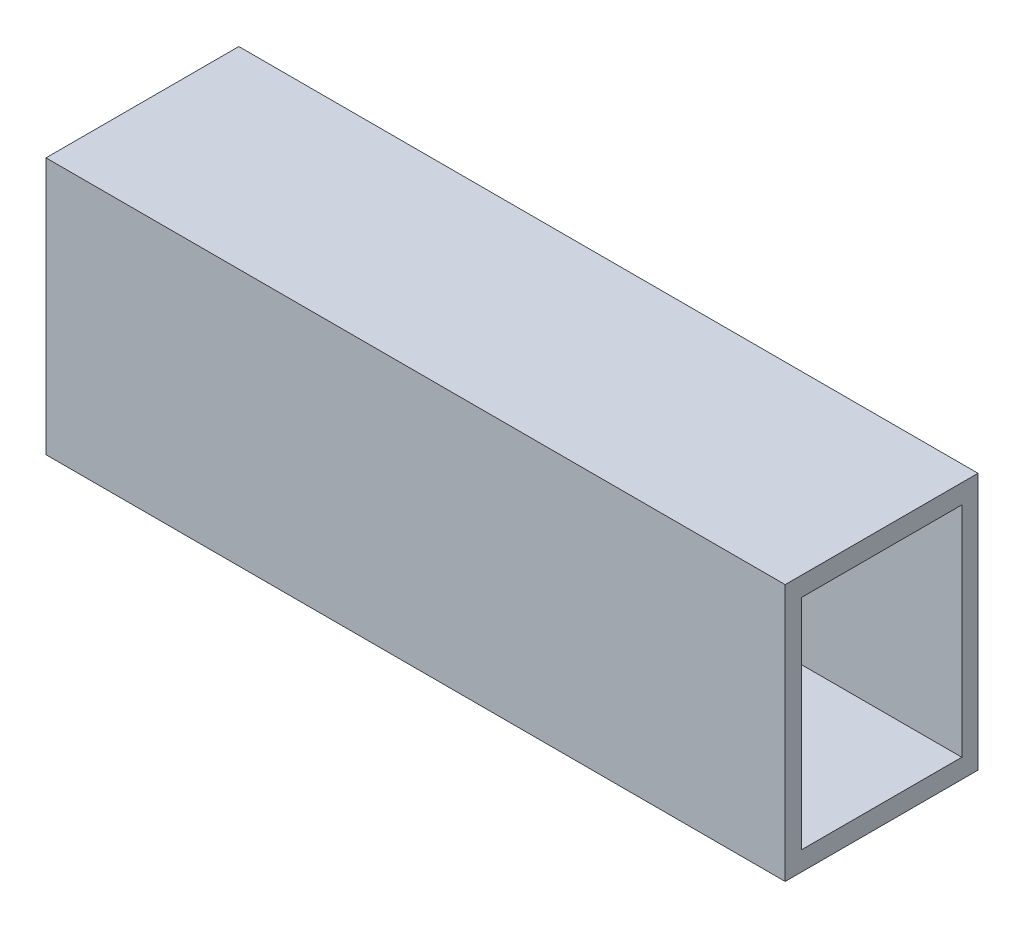
ISO-10303-21;
HEADER;
FILE_DESCRIPTION(('STEP AP214'),'2;1');
FILE_NAME('part.step','',(''),(''),'','','');
FILE_SCHEMA(('AUTOMOTIVE_DESIGN { 1 0 10303 214 1 1 1 1 }'));
ENDSEC;
DATA;
#1=APPLICATION_CONTEXT('core data for automotive mechanical design processes');
#2=APPLICATION_PROTOCOL_DEFINITION('international standard','automotive_design',2000,#1);
#3=PRODUCT_CONTEXT('',#1,'mechanical');
#4=PRODUCT('Part','Part','',(#3));
#5=PRODUCT_RELATED_PRODUCT_CATEGORY('part','',(#4));
#6=PRODUCT_DEFINITION_FORMATION('','',#4);
#7=PRODUCT_DEFINITION_CONTEXT('part definition',#1,'design');
#8=PRODUCT_DEFINITION('design','',#6,#7);
#9=PRODUCT_DEFINITION_SHAPE('','',#8);
#10=(LENGTH_UNIT() NAMED_UNIT(*) SI_UNIT(.MILLI.,.METRE.));
#11=(NAMED_UNIT(*) PLANE_ANGLE_UNIT() SI_UNIT($,.RADIAN.));
#12=(NAMED_UNIT(*) SI_UNIT($,.STERADIAN.) SOLID_ANGLE_UNIT());
#13=UNCERTAINTY_MEASURE_WITH_UNIT(LENGTH_MEASURE(1.E-05),#10,'distance_accuracy_value','');
#14=(GEOMETRIC_REPRESENTATION_CONTEXT(3) GLOBAL_UNCERTAINTY_ASSIGNED_CONTEXT((#13)) GLOBAL_UNIT_ASSIGNED_CONTEXT((#10,
#11,#12)) REPRESENTATION_CONTEXT('',''));
#15=CARTESIAN_POINT('',(0.,0.,0.));
#16=DIRECTION('',(0.,0.,1.));
#17=DIRECTION('',(1.,0.,0.));
#18=AXIS2_PLACEMENT_3D('',#15,#16,#17);
#19=CARTESIAN_POINT('',(115.,0.,0.));
#20=DIRECTION('',(1.,0.,0.));
#21=DIRECTION('',(0.,0.,-1.));
#22=AXIS2_PLACEMENT_3D('',#19,#20,#21);
#23=PLANE('',#22);
#24=DIRECTION('',(0.,0.,-1.));
#25=VECTOR('',#24,1.);
#26=CARTESIAN_POINT('',(115.,-20.,15.));
#27=LINE('',#26,#25);
#28=CARTESIAN_POINT('',(115.,-20.,15.));
#29=VERTEX_POINT('',#28);
#30=CARTESIAN_POINT('',(115.,-20.,-15.));
#31=VERTEX_POINT('',#30);
#32=EDGE_CURVE('E134',#29,#31,#27,.T.);
#33=ORIENTED_EDGE('',*,*,#32,.T.);
#34=DIRECTION('',(0.,1.,0.));
#35=VECTOR('',#34,1.);
#36=CARTESIAN_POINT('',(115.,-20.,-15.));
#37=LINE('',#36,#35);
#38=CARTESIAN_POINT('',(115.,20.,-15.));
#39=VERTEX_POINT('',#38);
#40=EDGE_CURVE('E137',#31,#39,#37,.T.);
#41=ORIENTED_EDGE('',*,*,#40,.T.);
#42=DIRECTION('',(0.,0.,1.));
#43=VECTOR('',#42,1.);
#44=CARTESIAN_POINT('',(115.,20.,15.));
#45=LINE('',#44,#43);
#46=CARTESIAN_POINT('',(115.,20.,15.));
#47=VERTEX_POINT('',#46);
#48=EDGE_CURVE('E140',#39,#47,#45,.T.);
#49=ORIENTED_EDGE('',*,*,#48,.T.);
#50=DIRECTION('',(0.,-1.,0.));
#51=VECTOR('',#50,1.);
#52=CARTESIAN_POINT('',(115.,-20.,15.));
#53=LINE('',#52,#51);
#54=EDGE_CURVE('E142',#47,#29,#53,.T.);
#55=ORIENTED_EDGE('',*,*,#54,.T.);
#56=EDGE_LOOP('',(#33,#41,#49,#55));
#57=FACE_BOUND('',#56,.T.);
#58=DIRECTION('',(0.,1.,0.));
#59=VECTOR('',#58,1.);
#60=CARTESIAN_POINT('',(115.,-17.,-12.4805313389132));
#61=LINE('',#60,#59);
#62=CARTESIAN_POINT('',(115.,-17.,-12.4805313389132));
#63=VERTEX_POINT('',#62);
#64=CARTESIAN_POINT('',(115.,17.,-12.4805313389132));
#65=VERTEX_POINT('',#64);
#66=EDGE_CURVE('E106',#63,#65,#61,.T.);
#67=ORIENTED_EDGE('',*,*,#66,.F.);
#68=DIRECTION('',(0.,0.,-1.));
#69=VECTOR('',#68,1.);
#70=CARTESIAN_POINT('',(115.,-17.,12.4805313389132));
#71=LINE('',#70,#69);
#72=CARTESIAN_POINT('',(115.,-17.,12.4805313389132));
#73=VERTEX_POINT('',#72);
#74=EDGE_CURVE('E98',#73,#63,#71,.T.);
#75=ORIENTED_EDGE('',*,*,#74,.F.);
#76=DIRECTION('',(0.,-1.,0.));
#77=VECTOR('',#76,1.);
#78=CARTESIAN_POINT('',(115.,-17.,12.4805313389132));
#79=LINE('',#78,#77);
#80=CARTESIAN_POINT('',(115.,17.,12.4805313389132));
#81=VERTEX_POINT('',#80);
#82=EDGE_CURVE('E120',#81,#73,#79,.T.);
#83=ORIENTED_EDGE('',*,*,#82,.F.);
#84=DIRECTION('',(0.,0.,1.));
#85=VECTOR('',#84,1.);
#86=CARTESIAN_POINT('',(115.,17.,12.4805313389132));
#87=LINE('',#86,#85);
#88=EDGE_CURVE('E118',#65,#81,#87,.T.);
#89=ORIENTED_EDGE('',*,*,#88,.F.);
#90=EDGE_LOOP('',(#67,#75,#83,#89));
#91=FACE_BOUND('',#90,.T.);
#92=ADVANCED_FACE('F33',(#57,#91),#23,.T.);
#93=CARTESIAN_POINT('',(0.,0.,0.));
#94=DIRECTION('',(1.,0.,0.));
#95=DIRECTION('',(0.,0.,-1.));
#96=AXIS2_PLACEMENT_3D('',#93,#94,#95);
#97=PLANE('',#96);
#98=DIRECTION('',(0.,0.,-1.));
#99=VECTOR('',#98,1.);
#100=CARTESIAN_POINT('',(0.,-20.,15.));
#101=LINE('',#100,#99);
#102=CARTESIAN_POINT('',(0.,-20.,15.));
#103=VERTEX_POINT('',#102);
#104=CARTESIAN_POINT('',(0.,-20.,-15.));
#105=VERTEX_POINT('',#104);
#106=EDGE_CURVE('E114',#103,#105,#101,.T.);
#107=ORIENTED_EDGE('',*,*,#106,.F.);
#108=DIRECTION('',(0.,-1.,0.));
#109=VECTOR('',#108,1.);
#110=CARTESIAN_POINT('',(0.,-20.,15.));
#111=LINE('',#110,#109);
#112=CARTESIAN_POINT('',(0.,20.,15.));
#113=VERTEX_POINT('',#112);
#114=EDGE_CURVE('E138',#113,#103,#111,.T.);
#115=ORIENTED_EDGE('',*,*,#114,.F.);
#116=DIRECTION('',(0.,0.,1.));
#117=VECTOR('',#116,1.);
#118=CARTESIAN_POINT('',(0.,20.,15.));
#119=LINE('',#118,#117);
#120=CARTESIAN_POINT('',(0.,20.,-15.));
#121=VERTEX_POINT('',#120);
#122=EDGE_CURVE('E149',#121,#113,#119,.T.);
#123=ORIENTED_EDGE('',*,*,#122,.F.);
#124=DIRECTION('',(0.,1.,0.));
#125=VECTOR('',#124,1.);
#126=CARTESIAN_POINT('',(0.,-20.,-15.));
#127=LINE('',#126,#125);
#128=EDGE_CURVE('E147',#105,#121,#127,.T.);
#129=ORIENTED_EDGE('',*,*,#128,.F.);
#130=EDGE_LOOP('',(#107,#115,#123,#129));
#131=FACE_BOUND('',#130,.T.);
#132=DIRECTION('',(0.,0.,-1.));
#133=VECTOR('',#132,1.);
#134=CARTESIAN_POINT('',(0.,-17.,12.4805313389132));
#135=LINE('',#134,#133);
#136=CARTESIAN_POINT('',(0.,-17.,12.4805313389132));
#137=VERTEX_POINT('',#136);
#138=CARTESIAN_POINT('',(0.,-17.,-12.4805313389132));
#139=VERTEX_POINT('',#138);
#140=EDGE_CURVE('E56',#137,#139,#135,.T.);
#141=ORIENTED_EDGE('',*,*,#140,.T.);
#142=DIRECTION('',(0.,1.,0.));
#143=VECTOR('',#142,1.);
#144=CARTESIAN_POINT('',(0.,-17.,-12.4805313389132));
#145=LINE('',#144,#143);
#146=CARTESIAN_POINT('',(0.,17.,-12.4805313389132));
#147=VERTEX_POINT('',#146);
#148=EDGE_CURVE('E113',#139,#147,#145,.T.);
#149=ORIENTED_EDGE('',*,*,#148,.T.);
#150=DIRECTION('',(0.,0.,1.));
#151=VECTOR('',#150,1.);
#152=CARTESIAN_POINT('',(0.,17.,12.4805313389132));
#153=LINE('',#152,#151);
#154=CARTESIAN_POINT('',(0.,17.,12.4805313389132));
#155=VERTEX_POINT('',#154);
#156=EDGE_CURVE('E126',#147,#155,#153,.T.);
#157=ORIENTED_EDGE('',*,*,#156,.T.);
#158=DIRECTION('',(0.,-1.,0.));
#159=VECTOR('',#158,1.);
#160=CARTESIAN_POINT('',(0.,-17.,12.4805313389132));
#161=LINE('',#160,#159);
#162=EDGE_CURVE('E107',#155,#137,#161,.T.);
#163=ORIENTED_EDGE('',*,*,#162,.T.);
#164=EDGE_LOOP('',(#141,#149,#157,#163));
#165=FACE_BOUND('',#164,.T.);
#166=ADVANCED_FACE('F167',(#131,#165),#97,.F.);
#167=CARTESIAN_POINT('',(115.,-20.,15.));
#168=DIRECTION('',(0.,1.,0.));
#169=DIRECTION('',(0.,0.,1.));
#170=AXIS2_PLACEMENT_3D('',#167,#168,#169);
#171=PLANE('',#170);
#172=ORIENTED_EDGE('',*,*,#106,.T.);
#173=DIRECTION('',(-1.,0.,0.));
#174=VECTOR('',#173,1.);
#175=CARTESIAN_POINT('',(115.,-20.,-15.));
#176=LINE('',#175,#174);
#177=EDGE_CURVE('E11',#31,#105,#176,.T.);
#178=ORIENTED_EDGE('',*,*,#177,.F.);
#179=ORIENTED_EDGE('',*,*,#32,.F.);
#180=DIRECTION('',(-1.,0.,0.));
#181=VECTOR('',#180,1.);
#182=CARTESIAN_POINT('',(115.,-20.,15.));
#183=LINE('',#182,#181);
#184=EDGE_CURVE('E144',#29,#103,#183,.T.);
#185=ORIENTED_EDGE('',*,*,#184,.T.);
#186=EDGE_LOOP('',(#172,#178,#179,#185));
#187=FACE_BOUND('',#186,.T.);
#188=ADVANCED_FACE('F35',(#187),#171,.F.);
#189=CARTESIAN_POINT('',(115.,-20.,-15.));
#190=DIRECTION('',(0.,0.,1.));
#191=DIRECTION('',(1.,0.,0.));
#192=AXIS2_PLACEMENT_3D('',#189,#190,#191);
#193=PLANE('',#192);
#194=ORIENTED_EDGE('',*,*,#128,.T.);
#195=DIRECTION('',(-1.,0.,0.));
#196=VECTOR('',#195,1.);
#197=CARTESIAN_POINT('',(115.,20.,-15.));
#198=LINE('',#197,#196);
#199=EDGE_CURVE('E41',#39,#121,#198,.T.);
#200=ORIENTED_EDGE('',*,*,#199,.F.);
#201=ORIENTED_EDGE('',*,*,#40,.F.);
#202=ORIENTED_EDGE('',*,*,#177,.T.);
#203=EDGE_LOOP('',(#194,#200,#201,#202));
#204=FACE_BOUND('',#203,.T.);
#205=ADVANCED_FACE('F177',(#204),#193,.F.);
#206=CARTESIAN_POINT('',(115.,20.,15.));
#207=DIRECTION('',(0.,-1.,0.));
#208=DIRECTION('',(0.,0.,-1.));
#209=AXIS2_PLACEMENT_3D('',#206,#207,#208);
#210=PLANE('',#209);
#211=ORIENTED_EDGE('',*,*,#122,.T.);
#212=DIRECTION('',(-1.,0.,0.));
#213=VECTOR('',#212,1.);
#214=CARTESIAN_POINT('',(115.,20.,15.));
#215=LINE('',#214,#213);
#216=EDGE_CURVE('E154',#47,#113,#215,.T.);
#217=ORIENTED_EDGE('',*,*,#216,.F.);
#218=ORIENTED_EDGE('',*,*,#48,.F.);
#219=ORIENTED_EDGE('',*,*,#199,.T.);
#220=EDGE_LOOP('',(#211,#217,#218,#219));
#221=FACE_BOUND('',#220,.T.);
#222=ADVANCED_FACE('F161',(#221),#210,.F.);
#223=CARTESIAN_POINT('',(115.,-20.,15.));
#224=DIRECTION('',(0.,0.,-1.));
#225=DIRECTION('',(-1.,0.,0.));
#226=AXIS2_PLACEMENT_3D('',#223,#224,#225);
#227=PLANE('',#226);
#228=ORIENTED_EDGE('',*,*,#114,.T.);
#229=ORIENTED_EDGE('',*,*,#184,.F.);
#230=ORIENTED_EDGE('',*,*,#54,.F.);
#231=ORIENTED_EDGE('',*,*,#216,.T.);
#232=EDGE_LOOP('',(#228,#229,#230,#231));
#233=FACE_BOUND('',#232,.T.);
#234=ADVANCED_FACE('F171',(#233),#227,.F.);
#235=CARTESIAN_POINT('',(115.,-17.,12.4805313389132));
#236=DIRECTION('',(0.,1.,0.));
#237=DIRECTION('',(0.,0.,1.));
#238=AXIS2_PLACEMENT_3D('',#235,#236,#237);
#239=PLANE('',#238);
#240=ORIENTED_EDGE('',*,*,#140,.F.);
#241=DIRECTION('',(-1.,0.,0.));
#242=VECTOR('',#241,1.);
#243=CARTESIAN_POINT('',(115.,-17.,12.4805313389132));
#244=LINE('',#243,#242);
#245=EDGE_CURVE('E102',#73,#137,#244,.T.);
#246=ORIENTED_EDGE('',*,*,#245,.F.);
#247=ORIENTED_EDGE('',*,*,#74,.T.);
#248=DIRECTION('',(-1.,0.,0.));
#249=VECTOR('',#248,1.);
#250=CARTESIAN_POINT('',(115.,-17.,-12.4805313389132));
#251=LINE('',#250,#249);
#252=EDGE_CURVE('E101',#63,#139,#251,.T.);
#253=ORIENTED_EDGE('',*,*,#252,.T.);
#254=EDGE_LOOP('',(#240,#246,#247,#253));
#255=FACE_BOUND('',#254,.T.);
#256=ADVANCED_FACE('F100',(#255),#239,.T.);
#257=CARTESIAN_POINT('',(115.,-17.,-12.4805313389132));
#258=DIRECTION('',(0.,0.,1.));
#259=DIRECTION('',(1.,0.,0.));
#260=AXIS2_PLACEMENT_3D('',#257,#258,#259);
#261=PLANE('',#260);
#262=ORIENTED_EDGE('',*,*,#148,.F.);
#263=ORIENTED_EDGE('',*,*,#252,.F.);
#264=ORIENTED_EDGE('',*,*,#66,.T.);
#265=DIRECTION('',(-1.,0.,0.));
#266=VECTOR('',#265,1.);
#267=CARTESIAN_POINT('',(115.,17.,-12.4805313389132));
#268=LINE('',#267,#266);
#269=EDGE_CURVE('E115',#65,#147,#268,.T.);
#270=ORIENTED_EDGE('',*,*,#269,.T.);
#271=EDGE_LOOP('',(#262,#263,#264,#270));
#272=FACE_BOUND('',#271,.T.);
#273=ADVANCED_FACE('F110',(#272),#261,.T.);
#274=CARTESIAN_POINT('',(115.,17.,12.4805313389132));
#275=DIRECTION('',(0.,-1.,0.));
#276=DIRECTION('',(0.,0.,-1.));
#277=AXIS2_PLACEMENT_3D('',#274,#275,#276);
#278=PLANE('',#277);
#279=ORIENTED_EDGE('',*,*,#156,.F.);
#280=ORIENTED_EDGE('',*,*,#269,.F.);
#281=ORIENTED_EDGE('',*,*,#88,.T.);
#282=DIRECTION('',(-1.,0.,0.));
#283=VECTOR('',#282,1.);
#284=CARTESIAN_POINT('',(115.,17.,12.4805313389132));
#285=LINE('',#284,#283);
#286=EDGE_CURVE('E48',#81,#155,#285,.T.);
#287=ORIENTED_EDGE('',*,*,#286,.T.);
#288=EDGE_LOOP('',(#279,#280,#281,#287));
#289=FACE_BOUND('',#288,.T.);
#290=ADVANCED_FACE('F200',(#289),#278,.T.);
#291=CARTESIAN_POINT('',(115.,-17.,12.4805313389132));
#292=DIRECTION('',(0.,0.,-1.));
#293=DIRECTION('',(-1.,0.,0.));
#294=AXIS2_PLACEMENT_3D('',#291,#292,#293);
#295=PLANE('',#294);
#296=ORIENTED_EDGE('',*,*,#162,.F.);
#297=ORIENTED_EDGE('',*,*,#286,.F.);
#298=ORIENTED_EDGE('',*,*,#82,.T.);
#299=ORIENTED_EDGE('',*,*,#245,.T.);
#300=EDGE_LOOP('',(#296,#297,#298,#299));
#301=FACE_BOUND('',#300,.T.);
#302=ADVANCED_FACE('F204',(#301),#295,.T.);
#303=CLOSED_SHELL('',(#92,#166,#188,#205,#222,#234,#256,#273,#290,#302));
#304=MANIFOLD_SOLID_BREP('B2',#303);
#305=ADVANCED_BREP_SHAPE_REPRESENTATION('',(#18,#304),#14);
#306=SHAPE_DEFINITION_REPRESENTATION(#9,#305);
ENDSEC;
END-ISO-10303-21;
